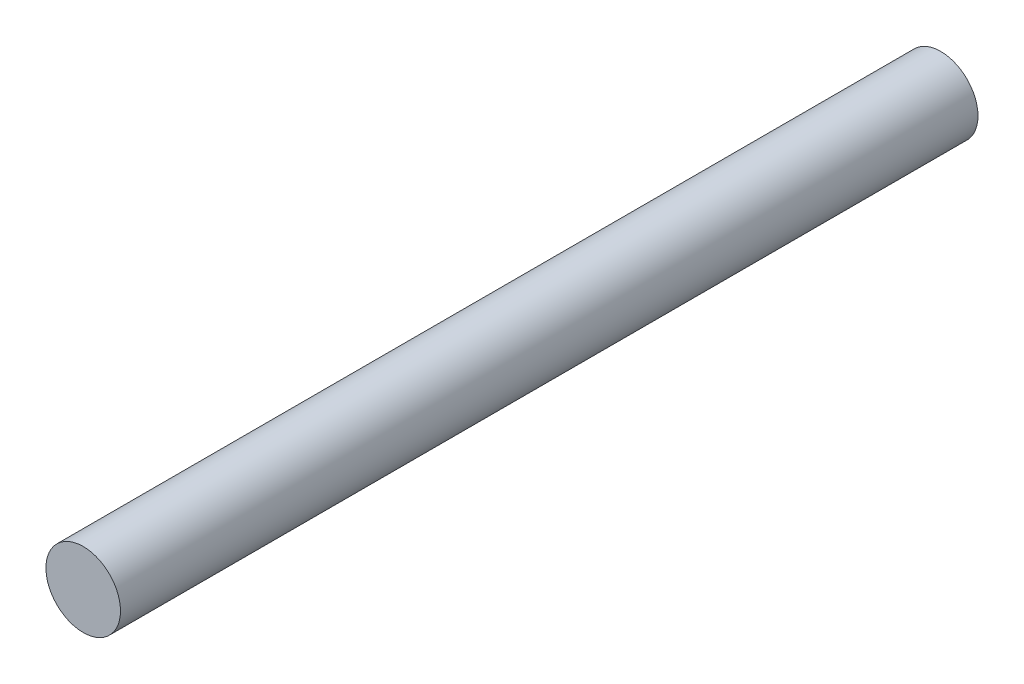
ISO-10303-21;
HEADER;
FILE_DESCRIPTION(('STEP AP214'),'2;1');
FILE_NAME('part.step','',(''),(''),'','','');
FILE_SCHEMA(('AUTOMOTIVE_DESIGN { 1 0 10303 214 1 1 1 1 }'));
ENDSEC;
DATA;
#1=APPLICATION_CONTEXT('core data for automotive mechanical design processes');
#2=APPLICATION_PROTOCOL_DEFINITION('international standard','automotive_design',2000,#1);
#3=PRODUCT_CONTEXT('',#1,'mechanical');
#4=PRODUCT('Part','Part','',(#3));
#5=PRODUCT_RELATED_PRODUCT_CATEGORY('part','',(#4));
#6=PRODUCT_DEFINITION_FORMATION('','',#4);
#7=PRODUCT_DEFINITION_CONTEXT('part definition',#1,'design');
#8=PRODUCT_DEFINITION('design','',#6,#7);
#9=PRODUCT_DEFINITION_SHAPE('','',#8);
#10=(LENGTH_UNIT() NAMED_UNIT(*) SI_UNIT(.MILLI.,.METRE.));
#11=(NAMED_UNIT(*) PLANE_ANGLE_UNIT() SI_UNIT($,.RADIAN.));
#12=(NAMED_UNIT(*) SI_UNIT($,.STERADIAN.) SOLID_ANGLE_UNIT());
#13=UNCERTAINTY_MEASURE_WITH_UNIT(LENGTH_MEASURE(1.E-05),#10,'distance_accuracy_value','');
#14=(GEOMETRIC_REPRESENTATION_CONTEXT(3) GLOBAL_UNCERTAINTY_ASSIGNED_CONTEXT((#13)) GLOBAL_UNIT_ASSIGNED_CONTEXT((#10,
#11,#12)) REPRESENTATION_CONTEXT('',''));
#15=CARTESIAN_POINT('',(0.,0.,0.));
#16=DIRECTION('',(0.,0.,1.));
#17=DIRECTION('',(1.,0.,0.));
#18=AXIS2_PLACEMENT_3D('',#15,#16,#17);
#19=CARTESIAN_POINT('',(0.,0.,23.));
#20=DIRECTION('',(0.,0.,-1.));
#21=DIRECTION('',(-1.,0.,0.));
#22=AXIS2_PLACEMENT_3D('',#19,#20,#21);
#23=CYLINDRICAL_SURFACE('',#22,1.);
#24=CARTESIAN_POINT('',(0.,0.,23.));
#25=DIRECTION('',(0.,0.,1.));
#26=DIRECTION('',(1.,0.,0.));
#27=AXIS2_PLACEMENT_3D('',#24,#25,#26);
#28=CIRCLE('',#27,1.);
#29=CARTESIAN_POINT('',(1.,0.,23.));
#30=VERTEX_POINT('',#29);
#31=EDGE_CURVE('E10',#30,#30,#28,.T.);
#32=ORIENTED_EDGE('',*,*,#31,.F.);
#33=EDGE_LOOP('',(#32));
#34=FACE_BOUND('',#33,.T.);
#35=CARTESIAN_POINT('',(0.,0.,0.));
#36=DIRECTION('',(0.,0.,1.));
#37=DIRECTION('',(1.,0.,0.));
#38=AXIS2_PLACEMENT_3D('',#35,#36,#37);
#39=CIRCLE('',#38,1.);
#40=CARTESIAN_POINT('',(1.,0.,0.));
#41=VERTEX_POINT('',#40);
#42=EDGE_CURVE('E38',#41,#41,#39,.T.);
#43=ORIENTED_EDGE('',*,*,#42,.T.);
#44=EDGE_LOOP('',(#43));
#45=FACE_BOUND('',#44,.T.);
#46=ADVANCED_FACE('F35',(#34,#45),#23,.T.);
#47=CARTESIAN_POINT('',(0.,0.,23.));
#48=DIRECTION('',(0.,0.,1.));
#49=DIRECTION('',(1.,0.,0.));
#50=AXIS2_PLACEMENT_3D('',#47,#48,#49);
#51=PLANE('',#50);
#52=ORIENTED_EDGE('',*,*,#31,.T.);
#53=EDGE_LOOP('',(#52));
#54=FACE_BOUND('',#53,.T.);
#55=ADVANCED_FACE('F50',(#54),#51,.T.);
#56=CARTESIAN_POINT('',(0.,0.,0.));
#57=DIRECTION('',(0.,0.,1.));
#58=DIRECTION('',(1.,0.,0.));
#59=AXIS2_PLACEMENT_3D('',#56,#57,#58);
#60=PLANE('',#59);
#61=ORIENTED_EDGE('',*,*,#42,.F.);
#62=EDGE_LOOP('',(#61));
#63=FACE_BOUND('',#62,.T.);
#64=ADVANCED_FACE('F48',(#63),#60,.F.);
#65=CLOSED_SHELL('',(#46,#55,#64));
#66=MANIFOLD_SOLID_BREP('B2',#65);
#67=ADVANCED_BREP_SHAPE_REPRESENTATION('',(#18,#66),#14);
#68=SHAPE_DEFINITION_REPRESENTATION(#9,#67);
ENDSEC;
END-ISO-10303-21;
